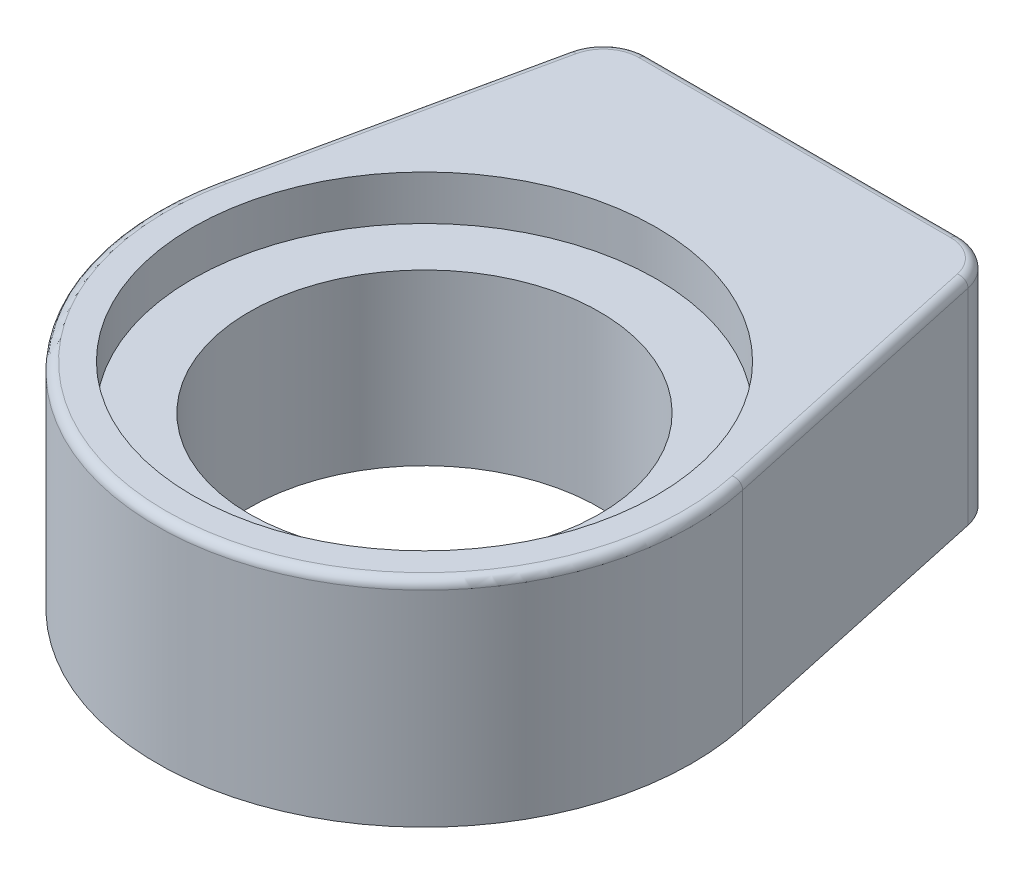
ISO-10303-21;
HEADER;
FILE_DESCRIPTION(('STEP AP214'),'2;1');
FILE_NAME('part.step','',(''),(''),'','','');
FILE_SCHEMA(('AUTOMOTIVE_DESIGN { 1 0 10303 214 1 1 1 1 }'));
ENDSEC;
DATA;
#1=APPLICATION_CONTEXT('core data for automotive mechanical design processes');
#2=APPLICATION_PROTOCOL_DEFINITION('international standard','automotive_design',2000,#1);
#3=PRODUCT_CONTEXT('',#1,'mechanical');
#4=PRODUCT('Part','Part','',(#3));
#5=PRODUCT_RELATED_PRODUCT_CATEGORY('part','',(#4));
#6=PRODUCT_DEFINITION_FORMATION('','',#4);
#7=PRODUCT_DEFINITION_CONTEXT('part definition',#1,'design');
#8=PRODUCT_DEFINITION('design','',#6,#7);
#9=PRODUCT_DEFINITION_SHAPE('','',#8);
#10=(LENGTH_UNIT() NAMED_UNIT(*) SI_UNIT(.MILLI.,.METRE.));
#11=(NAMED_UNIT(*) PLANE_ANGLE_UNIT() SI_UNIT($,.RADIAN.));
#12=(NAMED_UNIT(*) SI_UNIT($,.STERADIAN.) SOLID_ANGLE_UNIT());
#13=UNCERTAINTY_MEASURE_WITH_UNIT(LENGTH_MEASURE(1.E-05),#10,'distance_accuracy_value','');
#14=(GEOMETRIC_REPRESENTATION_CONTEXT(3) GLOBAL_UNCERTAINTY_ASSIGNED_CONTEXT((#13)) GLOBAL_UNIT_ASSIGNED_CONTEXT((#10,
#11,#12)) REPRESENTATION_CONTEXT('',''));
#15=CARTESIAN_POINT('',(0.,0.,0.));
#16=DIRECTION('',(0.,0.,1.));
#17=DIRECTION('',(1.,0.,0.));
#18=AXIS2_PLACEMENT_3D('',#15,#16,#17);
#19=CARTESIAN_POINT('',(0.,0.,0.));
#20=DIRECTION('',(0.,1.,0.));
#21=DIRECTION('',(0.,0.,1.));
#22=AXIS2_PLACEMENT_3D('',#19,#20,#21);
#23=CYLINDRICAL_SURFACE('',#22,9.9695);
#24=CARTESIAN_POINT('',(0.,0.,0.));
#25=DIRECTION('',(0.,1.,0.));
#26=DIRECTION('',(0.,0.,1.));
#27=AXIS2_PLACEMENT_3D('',#24,#25,#26);
#28=CIRCLE('',#27,9.9695);
#29=CARTESIAN_POINT('',(0.,0.,9.9695));
#30=VERTEX_POINT('',#29);
#31=EDGE_CURVE('E170',#30,#30,#28,.T.);
#32=ORIENTED_EDGE('',*,*,#31,.F.);
#33=EDGE_LOOP('',(#32));
#34=FACE_BOUND('',#33,.T.);
#35=CARTESIAN_POINT('',(0.,9.652,0.));
#36=DIRECTION('',(0.,1.,0.));
#37=DIRECTION('',(0.,0.,1.));
#38=AXIS2_PLACEMENT_3D('',#35,#36,#37);
#39=CIRCLE('',#38,9.9695);
#40=CARTESIAN_POINT('',(0.,9.652,9.9695));
#41=VERTEX_POINT('',#40);
#42=EDGE_CURVE('E36',#41,#41,#39,.F.);
#43=ORIENTED_EDGE('',*,*,#42,.F.);
#44=EDGE_LOOP('',(#43));
#45=FACE_BOUND('',#44,.T.);
#46=ADVANCED_FACE('F32',(#34,#45),#23,.F.);
#47=CARTESIAN_POINT('',(-14.8954477623901,12.192,-3.22230289667326));
#48=DIRECTION('',(0.977391585458665,0.,0.21143719794444));
#49=DIRECTION('',(0.21143719794444,0.,-0.977391585458666));
#50=AXIS2_PLACEMENT_3D('',#47,#48,#49);
#51=PLANE('',#50);
#52=DIRECTION('',(0.,-1.,0.));
#53=VECTOR('',#52,1.);
#54=CARTESIAN_POINT('',(-14.8954477623901,12.192,-3.22230289667327));
#55=LINE('',#54,#53);
#56=CARTESIAN_POINT('',(-14.8954477623901,11.684,-3.22230289667327));
#57=VERTEX_POINT('',#56);
#58=CARTESIAN_POINT('',(-14.8954477623901,0.,-3.22230289667327));
#59=VERTEX_POINT('',#58);
#60=EDGE_CURVE('E104',#57,#59,#55,.T.);
#61=ORIENTED_EDGE('',*,*,#60,.F.);
#62=DIRECTION('',(-0.21143719794444,0.,0.977391585458666));
#63=VECTOR('',#62,1.);
#64=CARTESIAN_POINT('',(-11.355294126782,11.684,-19.5870504827789));
#65=LINE('',#64,#63);
#66=CARTESIAN_POINT('',(-11.355294126782,11.684,-19.5870504827789));
#67=VERTEX_POINT('',#66);
#68=EDGE_CURVE('E56',#57,#67,#65,.F.);
#69=ORIENTED_EDGE('',*,*,#68,.T.);
#70=DIRECTION('',(0.,-1.,0.));
#71=VECTOR('',#70,1.);
#72=CARTESIAN_POINT('',(-11.355294126782,12.192,-19.5870504827789));
#73=LINE('',#72,#71);
#74=CARTESIAN_POINT('',(-11.355294126782,0.,-19.5870504827789));
#75=VERTEX_POINT('',#74);
#76=EDGE_CURVE('E113',#67,#75,#73,.T.);
#77=ORIENTED_EDGE('',*,*,#76,.T.);
#78=DIRECTION('',(-0.21143719794444,0.,0.977391585458665));
#79=VECTOR('',#78,1.);
#80=CARTESIAN_POINT('',(-14.8954477623901,0.,-3.22230289667326));
#81=LINE('',#80,#79);
#82=EDGE_CURVE('E117',#75,#59,#81,.T.);
#83=ORIENTED_EDGE('',*,*,#82,.T.);
#84=EDGE_LOOP('',(#61,#69,#77,#83));
#85=FACE_BOUND('',#84,.T.);
#86=ADVANCED_FACE('F118',(#85),#51,.F.);
#87=CARTESIAN_POINT('',(0.,12.192,0.));
#88=DIRECTION('',(0.,-1.,0.));
#89=DIRECTION('',(0.,0.,-1.));
#90=AXIS2_PLACEMENT_3D('',#87,#88,#89);
#91=CYLINDRICAL_SURFACE('',#90,15.24);
#92=DIRECTION('',(0.,-1.,0.));
#93=VECTOR('',#92,1.);
#94=CARTESIAN_POINT('',(14.8954477623901,12.192,-3.22230289667326));
#95=LINE('',#94,#93);
#96=CARTESIAN_POINT('',(14.8954477623901,11.684,-3.22230289667326));
#97=VERTEX_POINT('',#96);
#98=CARTESIAN_POINT('',(14.8954477623901,0.,-3.22230289667326));
#99=VERTEX_POINT('',#98);
#100=EDGE_CURVE('E114',#97,#99,#95,.T.);
#101=ORIENTED_EDGE('',*,*,#100,.F.);
#102=CARTESIAN_POINT('',(0.,11.684,0.));
#103=DIRECTION('',(0.,1.,0.));
#104=DIRECTION('',(0.,0.,1.));
#105=AXIS2_PLACEMENT_3D('',#102,#103,#104);
#106=CIRCLE('',#105,15.24);
#107=EDGE_CURVE('E112',#97,#57,#106,.F.);
#108=ORIENTED_EDGE('',*,*,#107,.T.);
#109=ORIENTED_EDGE('',*,*,#60,.T.);
#110=CARTESIAN_POINT('',(0.,0.,0.));
#111=DIRECTION('',(0.,1.,0.));
#112=DIRECTION('',(0.,0.,1.));
#113=AXIS2_PLACEMENT_3D('',#110,#111,#112);
#114=CIRCLE('',#113,15.24);
#115=EDGE_CURVE('E109',#59,#99,#114,.T.);
#116=ORIENTED_EDGE('',*,*,#115,.T.);
#117=EDGE_LOOP('',(#101,#108,#109,#116));
#118=FACE_BOUND('',#117,.T.);
#119=ADVANCED_FACE('F107',(#118),#91,.T.);
#120=CARTESIAN_POINT('',(14.8954477623901,12.192,-3.22230289667326));
#121=DIRECTION('',(-0.977391585458665,0.,0.21143719794444));
#122=DIRECTION('',(0.21143719794444,0.,0.977391585458666));
#123=AXIS2_PLACEMENT_3D('',#120,#121,#122);
#124=PLANE('',#123);
#125=DIRECTION('',(0.,-1.,0.));
#126=VECTOR('',#125,1.);
#127=CARTESIAN_POINT('',(11.355294126782,12.192,-19.5870504827789));
#128=LINE('',#127,#126);
#129=CARTESIAN_POINT('',(11.355294126782,0.,-19.5870504827789));
#130=VERTEX_POINT('',#129);
#131=CARTESIAN_POINT('',(11.355294126782,11.684,-19.5870504827789));
#132=VERTEX_POINT('',#131);
#133=EDGE_CURVE('E143',#130,#132,#128,.F.);
#134=ORIENTED_EDGE('',*,*,#133,.T.);
#135=DIRECTION('',(-0.21143719794444,0.,-0.977391585458666));
#136=VECTOR('',#135,1.);
#137=CARTESIAN_POINT('',(14.8954477623901,11.684,-3.22230289667326));
#138=LINE('',#137,#136);
#139=EDGE_CURVE('E162',#132,#97,#138,.F.);
#140=ORIENTED_EDGE('',*,*,#139,.T.);
#141=ORIENTED_EDGE('',*,*,#100,.T.);
#142=DIRECTION('',(-0.21143719794444,0.,-0.977391585458665));
#143=VECTOR('',#142,1.);
#144=CARTESIAN_POINT('',(14.8954477623901,0.,-3.22230289667326));
#145=LINE('',#144,#143);
#146=EDGE_CURVE('E125',#99,#130,#145,.T.);
#147=ORIENTED_EDGE('',*,*,#146,.T.);
#148=EDGE_LOOP('',(#134,#140,#141,#147));
#149=FACE_BOUND('',#148,.T.);
#150=ADVANCED_FACE('F216',(#149),#124,.F.);
#151=CARTESIAN_POINT('',(-10.922,12.192,-21.59));
#152=DIRECTION('',(0.,0.,1.));
#153=DIRECTION('',(1.,0.,0.));
#154=AXIS2_PLACEMENT_3D('',#151,#152,#153);
#155=PLANE('',#154);
#156=DIRECTION('',(0.,-1.,0.));
#157=VECTOR('',#156,1.);
#158=CARTESIAN_POINT('',(-8.87271949971701,12.192,-21.59));
#159=LINE('',#158,#157);
#160=CARTESIAN_POINT('',(-8.87271949971701,0.,-21.59));
#161=VERTEX_POINT('',#160);
#162=CARTESIAN_POINT('',(-8.87271949971701,11.684,-21.59));
#163=VERTEX_POINT('',#162);
#164=EDGE_CURVE('E141',#161,#163,#159,.F.);
#165=ORIENTED_EDGE('',*,*,#164,.T.);
#166=DIRECTION('',(-1.,0.,0.));
#167=VECTOR('',#166,1.);
#168=CARTESIAN_POINT('',(8.87271949971701,11.684,-21.59));
#169=LINE('',#168,#167);
#170=CARTESIAN_POINT('',(8.87271949971701,11.684,-21.59));
#171=VERTEX_POINT('',#170);
#172=EDGE_CURVE('E11',#163,#171,#169,.F.);
#173=ORIENTED_EDGE('',*,*,#172,.T.);
#174=DIRECTION('',(0.,-1.,0.));
#175=VECTOR('',#174,1.);
#176=CARTESIAN_POINT('',(8.87271949971701,12.192,-21.59));
#177=LINE('',#176,#175);
#178=CARTESIAN_POINT('',(8.87271949971701,0.,-21.59));
#179=VERTEX_POINT('',#178);
#180=EDGE_CURVE('E139',#171,#179,#177,.T.);
#181=ORIENTED_EDGE('',*,*,#180,.T.);
#182=DIRECTION('',(-1.,0.,0.));
#183=VECTOR('',#182,1.);
#184=CARTESIAN_POINT('',(-10.922,0.,-21.59));
#185=LINE('',#184,#183);
#186=EDGE_CURVE('E127',#179,#161,#185,.T.);
#187=ORIENTED_EDGE('',*,*,#186,.T.);
#188=EDGE_LOOP('',(#165,#173,#181,#187));
#189=FACE_BOUND('',#188,.T.);
#190=ADVANCED_FACE('F200',(#189),#155,.F.);
#191=CARTESIAN_POINT('',(0.,12.192,0.));
#192=DIRECTION('',(0.,1.,0.));
#193=DIRECTION('',(0.,0.,1.));
#194=AXIS2_PLACEMENT_3D('',#191,#192,#193);
#195=PLANE('',#194);
#196=CARTESIAN_POINT('',(0.,12.192,0.));
#197=DIRECTION('',(0.,1.,0.));
#198=DIRECTION('',(0.,0.,1.));
#199=AXIS2_PLACEMENT_3D('',#196,#197,#198);
#200=CIRCLE('',#199,13.208);
#201=CARTESIAN_POINT('',(0.,12.192,13.208));
#202=VERTEX_POINT('',#201);
#203=EDGE_CURVE('E253',#202,#202,#200,.T.);
#204=ORIENTED_EDGE('',*,*,#203,.F.);
#205=EDGE_LOOP('',(#204));
#206=FACE_BOUND('',#205,.T.);
#207=DIRECTION('',(-0.21143719794444,0.,-0.977391585458666));
#208=VECTOR('',#207,1.);
#209=CARTESIAN_POINT('',(10.858779201369,12.192,-19.4796403862231));
#210=LINE('',#209,#208);
#211=CARTESIAN_POINT('',(14.3989328369771,12.192,-3.11489280011749));
#212=VERTEX_POINT('',#211);
#213=CARTESIAN_POINT('',(10.858779201369,12.192,-19.4796403862231));
#214=VERTEX_POINT('',#213);
#215=EDGE_CURVE('E154',#212,#214,#210,.T.);
#216=ORIENTED_EDGE('',*,*,#215,.T.);
#217=CARTESIAN_POINT('',(8.87271949971701,12.192,-19.05));
#218=DIRECTION('',(0.,1.,0.));
#219=DIRECTION('',(0.,0.,1.));
#220=AXIS2_PLACEMENT_3D('',#217,#218,#219);
#221=CIRCLE('',#220,2.032);
#222=CARTESIAN_POINT('',(8.87271949971701,12.192,-21.082));
#223=VERTEX_POINT('',#222);
#224=EDGE_CURVE('E156',#214,#223,#221,.T.);
#225=ORIENTED_EDGE('',*,*,#224,.T.);
#226=DIRECTION('',(-1.,0.,0.));
#227=VECTOR('',#226,1.);
#228=CARTESIAN_POINT('',(-8.87271949971701,12.192,-21.082));
#229=LINE('',#228,#227);
#230=CARTESIAN_POINT('',(-8.87271949971701,12.192,-21.082));
#231=VERTEX_POINT('',#230);
#232=EDGE_CURVE('E146',#223,#231,#229,.T.);
#233=ORIENTED_EDGE('',*,*,#232,.T.);
#234=CARTESIAN_POINT('',(-8.87271949971701,12.192,-19.05));
#235=DIRECTION('',(0.,1.,0.));
#236=DIRECTION('',(0.,0.,1.));
#237=AXIS2_PLACEMENT_3D('',#234,#235,#236);
#238=CIRCLE('',#237,2.032);
#239=CARTESIAN_POINT('',(-10.858779201369,12.192,-19.4796403862231));
#240=VERTEX_POINT('',#239);
#241=EDGE_CURVE('E148',#231,#240,#238,.T.);
#242=ORIENTED_EDGE('',*,*,#241,.T.);
#243=DIRECTION('',(-0.21143719794444,0.,0.977391585458666));
#244=VECTOR('',#243,1.);
#245=CARTESIAN_POINT('',(-14.3989328369771,12.192,-3.1148928001175));
#246=LINE('',#245,#244);
#247=CARTESIAN_POINT('',(-14.3989328369771,12.192,-3.1148928001175));
#248=VERTEX_POINT('',#247);
#249=EDGE_CURVE('E150',#240,#248,#246,.T.);
#250=ORIENTED_EDGE('',*,*,#249,.T.);
#251=CARTESIAN_POINT('',(0.,12.192,0.));
#252=DIRECTION('',(0.,1.,0.));
#253=DIRECTION('',(0.,0.,1.));
#254=AXIS2_PLACEMENT_3D('',#251,#252,#253);
#255=CIRCLE('',#254,14.732);
#256=EDGE_CURVE('E152',#248,#212,#255,.T.);
#257=ORIENTED_EDGE('',*,*,#256,.T.);
#258=EDGE_LOOP('',(#216,#225,#233,#242,#250,#257));
#259=FACE_BOUND('',#258,.T.);
#260=ADVANCED_FACE('F223',(#206,#259),#195,.T.);
#261=CARTESIAN_POINT('',(0.,0.,0.));
#262=DIRECTION('',(0.,1.,0.));
#263=DIRECTION('',(0.,0.,1.));
#264=AXIS2_PLACEMENT_3D('',#261,#262,#263);
#265=PLANE('',#264);
#266=ORIENTED_EDGE('',*,*,#31,.T.);
#267=EDGE_LOOP('',(#266));
#268=FACE_BOUND('',#267,.T.);
#269=ORIENTED_EDGE('',*,*,#82,.F.);
#270=CARTESIAN_POINT('',(-8.87271949971701,0.,-19.05));
#271=DIRECTION('',(0.,1.,0.));
#272=DIRECTION('',(0.,0.,1.));
#273=AXIS2_PLACEMENT_3D('',#270,#271,#272);
#274=CIRCLE('',#273,2.54);
#275=EDGE_CURVE('E137',#75,#161,#274,.F.);
#276=ORIENTED_EDGE('',*,*,#275,.T.);
#277=ORIENTED_EDGE('',*,*,#186,.F.);
#278=CARTESIAN_POINT('',(8.87271949971701,0.,-19.05));
#279=DIRECTION('',(0.,1.,0.));
#280=DIRECTION('',(0.,0.,1.));
#281=AXIS2_PLACEMENT_3D('',#278,#279,#280);
#282=CIRCLE('',#281,2.54);
#283=EDGE_CURVE('E135',#179,#130,#282,.F.);
#284=ORIENTED_EDGE('',*,*,#283,.T.);
#285=ORIENTED_EDGE('',*,*,#146,.F.);
#286=ORIENTED_EDGE('',*,*,#115,.F.);
#287=EDGE_LOOP('',(#269,#276,#277,#284,#285,#286));
#288=FACE_BOUND('',#287,.T.);
#289=ADVANCED_FACE('F123',(#268,#288),#265,.F.);
#290=CARTESIAN_POINT('',(-8.87271949971701,12.192,-19.05));
#291=DIRECTION('',(0.,-1.,0.));
#292=DIRECTION('',(0.,0.,-1.));
#293=AXIS2_PLACEMENT_3D('',#290,#291,#292);
#294=CYLINDRICAL_SURFACE('',#293,2.54);
#295=ORIENTED_EDGE('',*,*,#76,.F.);
#296=CARTESIAN_POINT('',(-8.87271949971701,11.684,-19.05));
#297=DIRECTION('',(0.,1.,0.));
#298=DIRECTION('',(0.,0.,1.));
#299=AXIS2_PLACEMENT_3D('',#296,#297,#298);
#300=CIRCLE('',#299,2.54);
#301=EDGE_CURVE('E41',#67,#163,#300,.F.);
#302=ORIENTED_EDGE('',*,*,#301,.T.);
#303=ORIENTED_EDGE('',*,*,#164,.F.);
#304=ORIENTED_EDGE('',*,*,#275,.F.);
#305=EDGE_LOOP('',(#295,#302,#303,#304));
#306=FACE_BOUND('',#305,.T.);
#307=ADVANCED_FACE('F243',(#306),#294,.T.);
#308=CARTESIAN_POINT('',(8.87271949971701,12.192,-19.05));
#309=DIRECTION('',(0.,-1.,0.));
#310=DIRECTION('',(0.,0.,-1.));
#311=AXIS2_PLACEMENT_3D('',#308,#309,#310);
#312=CYLINDRICAL_SURFACE('',#311,2.54);
#313=ORIENTED_EDGE('',*,*,#180,.F.);
#314=CARTESIAN_POINT('',(8.87271949971701,11.684,-19.05));
#315=DIRECTION('',(0.,1.,0.));
#316=DIRECTION('',(0.,0.,1.));
#317=AXIS2_PLACEMENT_3D('',#314,#315,#316);
#318=CIRCLE('',#317,2.54);
#319=EDGE_CURVE('E159',#171,#132,#318,.F.);
#320=ORIENTED_EDGE('',*,*,#319,.T.);
#321=ORIENTED_EDGE('',*,*,#133,.F.);
#322=ORIENTED_EDGE('',*,*,#283,.F.);
#323=EDGE_LOOP('',(#313,#320,#321,#322));
#324=FACE_BOUND('',#323,.T.);
#325=ADVANCED_FACE('F204',(#324),#312,.T.);
#326=CARTESIAN_POINT('',(-14.3989328369771,11.684,-3.11489280011749));
#327=DIRECTION('',(0.21143719794444,0.,-0.977391585458666));
#328=DIRECTION('',(-0.977391585458666,0.,-0.21143719794444));
#329=AXIS2_PLACEMENT_3D('',#326,#327,#328);
#330=CYLINDRICAL_SURFACE('',#329,0.508);
#331=CARTESIAN_POINT('',(-10.858779201369,11.684,-19.4796403862231));
#332=DIRECTION('',(0.211437197944441,0.,-0.977391585458665));
#333=DIRECTION('',(-0.977391585458665,0.,-0.211437197944441));
#334=AXIS2_PLACEMENT_3D('',#331,#332,#333);
#335=CIRCLE('',#334,0.508);
#336=EDGE_CURVE('E178',#67,#240,#335,.T.);
#337=ORIENTED_EDGE('',*,*,#336,.F.);
#338=ORIENTED_EDGE('',*,*,#68,.F.);
#339=CARTESIAN_POINT('',(-14.3989328369771,11.684,-3.1148928001175));
#340=DIRECTION('',(-0.21143719794444,0.,0.977391585458665));
#341=DIRECTION('',(0.977391585458665,0.,0.21143719794444));
#342=AXIS2_PLACEMENT_3D('',#339,#340,#341);
#343=CIRCLE('',#342,0.508);
#344=EDGE_CURVE('E121',#248,#57,#343,.T.);
#345=ORIENTED_EDGE('',*,*,#344,.F.);
#346=ORIENTED_EDGE('',*,*,#249,.F.);
#347=EDGE_LOOP('',(#337,#338,#345,#346));
#348=FACE_BOUND('',#347,.T.);
#349=ADVANCED_FACE('F34',(#348),#330,.T.);
#350=CARTESIAN_POINT('',(0.,11.684,0.));
#351=DIRECTION('',(0.,1.,0.));
#352=DIRECTION('',(0.,0.,1.));
#353=AXIS2_PLACEMENT_3D('',#350,#351,#352);
#354=TOROIDAL_SURFACE('',#353,14.732,0.508);
#355=ORIENTED_EDGE('',*,*,#344,.T.);
#356=ORIENTED_EDGE('',*,*,#107,.F.);
#357=CARTESIAN_POINT('',(14.3989328369771,11.684,-3.11489280011749));
#358=DIRECTION('',(-0.21143719794444,0.,-0.977391585458665));
#359=DIRECTION('',(-0.977391585458665,0.,0.21143719794444));
#360=AXIS2_PLACEMENT_3D('',#357,#358,#359);
#361=CIRCLE('',#360,0.508);
#362=EDGE_CURVE('E175',#212,#97,#361,.T.);
#363=ORIENTED_EDGE('',*,*,#362,.F.);
#364=ORIENTED_EDGE('',*,*,#256,.F.);
#365=EDGE_LOOP('',(#355,#356,#363,#364));
#366=FACE_BOUND('',#365,.T.);
#367=ADVANCED_FACE('F184',(#366),#354,.T.);
#368=CARTESIAN_POINT('',(-8.87271949971701,11.684,-19.05));
#369=DIRECTION('',(0.,1.,0.));
#370=DIRECTION('',(0.,0.,1.));
#371=AXIS2_PLACEMENT_3D('',#368,#369,#370);
#372=TOROIDAL_SURFACE('',#371,2.032,0.508);
#373=ORIENTED_EDGE('',*,*,#336,.T.);
#374=ORIENTED_EDGE('',*,*,#241,.F.);
#375=CARTESIAN_POINT('',(-8.87271949971701,11.684,-21.082));
#376=DIRECTION('',(1.,0.,0.));
#377=DIRECTION('',(0.,0.,-1.));
#378=AXIS2_PLACEMENT_3D('',#375,#376,#377);
#379=CIRCLE('',#378,0.508);
#380=EDGE_CURVE('E172',#163,#231,#379,.T.);
#381=ORIENTED_EDGE('',*,*,#380,.F.);
#382=ORIENTED_EDGE('',*,*,#301,.F.);
#383=EDGE_LOOP('',(#373,#374,#381,#382));
#384=FACE_BOUND('',#383,.T.);
#385=ADVANCED_FACE('F192',(#384),#372,.T.);
#386=CARTESIAN_POINT('',(14.3989328369771,11.684,-3.11489280011749));
#387=DIRECTION('',(0.21143719794444,0.,0.977391585458666));
#388=DIRECTION('',(0.977391585458666,0.,-0.21143719794444));
#389=AXIS2_PLACEMENT_3D('',#386,#387,#388);
#390=CYLINDRICAL_SURFACE('',#389,0.508);
#391=ORIENTED_EDGE('',*,*,#362,.T.);
#392=ORIENTED_EDGE('',*,*,#139,.F.);
#393=CARTESIAN_POINT('',(10.858779201369,11.684,-19.4796403862231));
#394=DIRECTION('',(-0.211437197944441,0.,-0.977391585458665));
#395=DIRECTION('',(-0.977391585458665,0.,0.211437197944441));
#396=AXIS2_PLACEMENT_3D('',#393,#394,#395);
#397=CIRCLE('',#396,0.508);
#398=EDGE_CURVE('E169',#214,#132,#397,.T.);
#399=ORIENTED_EDGE('',*,*,#398,.F.);
#400=ORIENTED_EDGE('',*,*,#215,.F.);
#401=EDGE_LOOP('',(#391,#392,#399,#400));
#402=FACE_BOUND('',#401,.T.);
#403=ADVANCED_FACE('F214',(#402),#390,.T.);
#404=CARTESIAN_POINT('',(0.,11.684,-21.082));
#405=DIRECTION('',(1.,0.,0.));
#406=DIRECTION('',(0.,0.,-1.));
#407=AXIS2_PLACEMENT_3D('',#404,#405,#406);
#408=CYLINDRICAL_SURFACE('',#407,0.508);
#409=ORIENTED_EDGE('',*,*,#380,.T.);
#410=ORIENTED_EDGE('',*,*,#232,.F.);
#411=CARTESIAN_POINT('',(8.87271949971701,11.684,-21.082));
#412=DIRECTION('',(1.,0.,0.));
#413=DIRECTION('',(0.,0.,-1.));
#414=AXIS2_PLACEMENT_3D('',#411,#412,#413);
#415=CIRCLE('',#414,0.508);
#416=EDGE_CURVE('E167',#171,#223,#415,.T.);
#417=ORIENTED_EDGE('',*,*,#416,.F.);
#418=ORIENTED_EDGE('',*,*,#172,.F.);
#419=EDGE_LOOP('',(#409,#410,#417,#418));
#420=FACE_BOUND('',#419,.T.);
#421=ADVANCED_FACE('F197',(#420),#408,.T.);
#422=CARTESIAN_POINT('',(8.87271949971701,11.684,-19.05));
#423=DIRECTION('',(0.,1.,0.));
#424=DIRECTION('',(0.,0.,1.));
#425=AXIS2_PLACEMENT_3D('',#422,#423,#424);
#426=TOROIDAL_SURFACE('',#425,2.032,0.508);
#427=ORIENTED_EDGE('',*,*,#398,.T.);
#428=ORIENTED_EDGE('',*,*,#319,.F.);
#429=ORIENTED_EDGE('',*,*,#416,.T.);
#430=ORIENTED_EDGE('',*,*,#224,.F.);
#431=EDGE_LOOP('',(#427,#428,#429,#430));
#432=FACE_BOUND('',#431,.T.);
#433=ADVANCED_FACE('F208',(#432),#426,.T.);
#434=CARTESIAN_POINT('',(0.,9.652,0.));
#435=DIRECTION('',(0.,1.,0.));
#436=DIRECTION('',(0.,0.,1.));
#437=AXIS2_PLACEMENT_3D('',#434,#435,#436);
#438=PLANE('',#437);
#439=CARTESIAN_POINT('',(0.,9.652,0.));
#440=DIRECTION('',(0.,1.,0.));
#441=DIRECTION('',(0.,0.,1.));
#442=AXIS2_PLACEMENT_3D('',#439,#440,#441);
#443=CIRCLE('',#442,13.208);
#444=CARTESIAN_POINT('',(0.,9.652,13.208));
#445=VERTEX_POINT('',#444);
#446=EDGE_CURVE('E251',#445,#445,#443,.T.);
#447=ORIENTED_EDGE('',*,*,#446,.T.);
#448=EDGE_LOOP('',(#447));
#449=FACE_BOUND('',#448,.T.);
#450=ORIENTED_EDGE('',*,*,#42,.T.);
#451=EDGE_LOOP('',(#450));
#452=FACE_BOUND('',#451,.T.);
#453=ADVANCED_FACE('F259',(#449,#452),#438,.T.);
#454=CARTESIAN_POINT('',(0.,9.652,0.));
#455=DIRECTION('',(0.,1.,0.));
#456=DIRECTION('',(0.,0.,1.));
#457=AXIS2_PLACEMENT_3D('',#454,#455,#456);
#458=CYLINDRICAL_SURFACE('',#457,13.208);
#459=ORIENTED_EDGE('',*,*,#446,.F.);
#460=EDGE_LOOP('',(#459));
#461=FACE_BOUND('',#460,.T.);
#462=ORIENTED_EDGE('',*,*,#203,.T.);
#463=EDGE_LOOP('',(#462));
#464=FACE_BOUND('',#463,.T.);
#465=ADVANCED_FACE('F237',(#461,#464),#458,.F.);
#466=CLOSED_SHELL('',(#46,#86,#119,#150,#190,#260,#289,#307,#325,#349,#367,#385,#403,#421,#433,
#453,#465));
#467=MANIFOLD_SOLID_BREP('B2',#466);
#468=ADVANCED_BREP_SHAPE_REPRESENTATION('',(#18,#467),#14);
#469=SHAPE_DEFINITION_REPRESENTATION(#9,#468);
ENDSEC;
END-ISO-10303-21;
